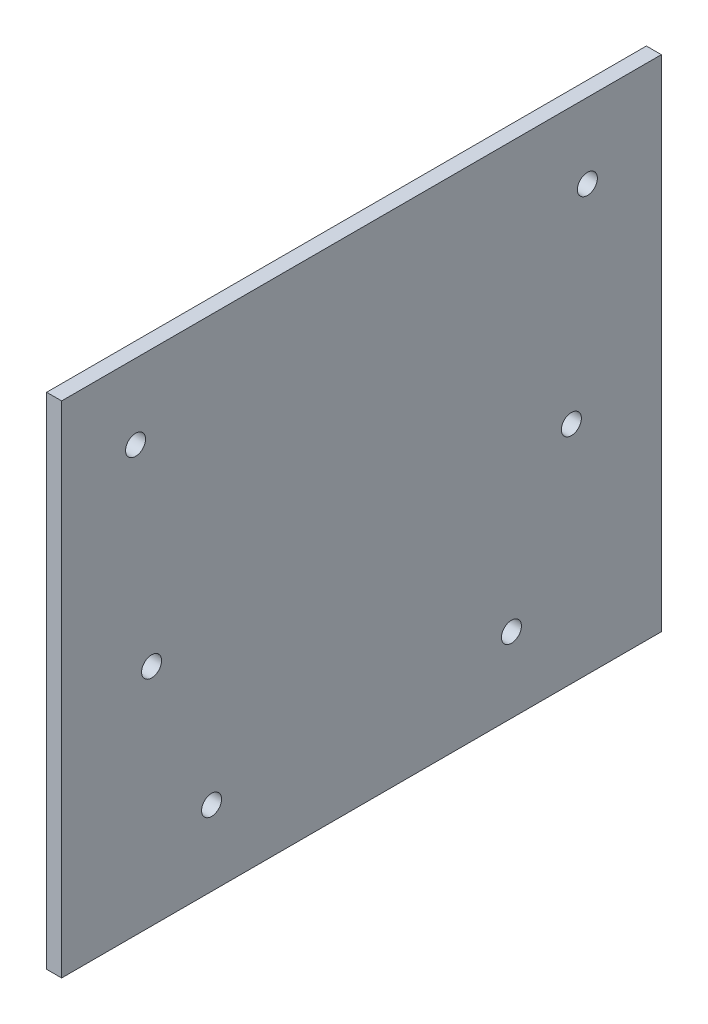
ISO-10303-21;
HEADER;
FILE_DESCRIPTION(('STEP AP214'),'2;1');
FILE_NAME('part.step','',(''),(''),'','','');
FILE_SCHEMA(('AUTOMOTIVE_DESIGN { 1 0 10303 214 1 1 1 1 }'));
ENDSEC;
DATA;
#1=APPLICATION_CONTEXT('core data for automotive mechanical design processes');
#2=APPLICATION_PROTOCOL_DEFINITION('international standard','automotive_design',2000,#1);
#3=PRODUCT_CONTEXT('',#1,'mechanical');
#4=PRODUCT('Part','Part','',(#3));
#5=PRODUCT_RELATED_PRODUCT_CATEGORY('part','',(#4));
#6=PRODUCT_DEFINITION_FORMATION('','',#4);
#7=PRODUCT_DEFINITION_CONTEXT('part definition',#1,'design');
#8=PRODUCT_DEFINITION('design','',#6,#7);
#9=PRODUCT_DEFINITION_SHAPE('','',#8);
#10=(LENGTH_UNIT() NAMED_UNIT(*) SI_UNIT(.MILLI.,.METRE.));
#11=(NAMED_UNIT(*) PLANE_ANGLE_UNIT() SI_UNIT($,.RADIAN.));
#12=(NAMED_UNIT(*) SI_UNIT($,.STERADIAN.) SOLID_ANGLE_UNIT());
#13=UNCERTAINTY_MEASURE_WITH_UNIT(LENGTH_MEASURE(1.E-05),#10,'distance_accuracy_value','');
#14=(GEOMETRIC_REPRESENTATION_CONTEXT(3) GLOBAL_UNCERTAINTY_ASSIGNED_CONTEXT((#13)) GLOBAL_UNIT_ASSIGNED_CONTEXT((#10,
#11,#12)) REPRESENTATION_CONTEXT('',''));
#15=CARTESIAN_POINT('',(0.,0.,0.));
#16=DIRECTION('',(0.,0.,1.));
#17=DIRECTION('',(1.,0.,0.));
#18=AXIS2_PLACEMENT_3D('',#15,#16,#17);
#19=CARTESIAN_POINT('',(3.,49.9810515296332,33.853534625365));
#20=DIRECTION('',(0.,0.,-1.));
#21=DIRECTION('',(0.,1.,0.));
#22=AXIS2_PLACEMENT_3D('',#19,#20,#21);
#23=PLANE('',#22);
#24=DIRECTION('',(0.,-1.,0.));
#25=VECTOR('',#24,1.);
#26=CARTESIAN_POINT('',(0.,49.9810515296332,33.853534625365));
#27=LINE('',#26,#25);
#28=CARTESIAN_POINT('',(0.,49.9810515296332,33.853534625365));
#29=VERTEX_POINT('',#28);
#30=CARTESIAN_POINT('',(0.,-50.0189484703668,33.853534625365));
#31=VERTEX_POINT('',#30);
#32=EDGE_CURVE('E96',#29,#31,#27,.T.);
#33=ORIENTED_EDGE('',*,*,#32,.T.);
#34=DIRECTION('',(-1.,0.,0.));
#35=VECTOR('',#34,1.);
#36=CARTESIAN_POINT('',(3.,-50.0189484703668,33.853534625365));
#37=LINE('',#36,#35);
#38=CARTESIAN_POINT('',(3.,-50.0189484703668,33.853534625365));
#39=VERTEX_POINT('',#38);
#40=EDGE_CURVE('E11',#39,#31,#37,.T.);
#41=ORIENTED_EDGE('',*,*,#40,.F.);
#42=DIRECTION('',(0.,-1.,0.));
#43=VECTOR('',#42,1.);
#44=CARTESIAN_POINT('',(3.,49.9810515296332,33.853534625365));
#45=LINE('',#44,#43);
#46=CARTESIAN_POINT('',(3.,49.9810515296332,33.853534625365));
#47=VERTEX_POINT('',#46);
#48=EDGE_CURVE('E84',#47,#39,#45,.T.);
#49=ORIENTED_EDGE('',*,*,#48,.F.);
#50=DIRECTION('',(-1.,0.,0.));
#51=VECTOR('',#50,1.);
#52=CARTESIAN_POINT('',(3.,49.9810515296332,33.853534625365));
#53=LINE('',#52,#51);
#54=EDGE_CURVE('E92',#47,#29,#53,.T.);
#55=ORIENTED_EDGE('',*,*,#54,.T.);
#56=EDGE_LOOP('',(#33,#41,#49,#55));
#57=FACE_BOUND('',#56,.T.);
#58=ADVANCED_FACE('F33',(#57),#23,.F.);
#59=CARTESIAN_POINT('',(3.,-50.0189484703668,33.853534625365));
#60=DIRECTION('',(0.,1.,0.));
#61=DIRECTION('',(0.,0.,1.));
#62=AXIS2_PLACEMENT_3D('',#59,#60,#61);
#63=PLANE('',#62);
#64=DIRECTION('',(0.,0.,-1.));
#65=VECTOR('',#64,1.);
#66=CARTESIAN_POINT('',(0.,-50.0189484703668,33.853534625365));
#67=LINE('',#66,#65);
#68=CARTESIAN_POINT('',(0.,-50.0189484703668,-86.146465374635));
#69=VERTEX_POINT('',#68);
#70=EDGE_CURVE('E88',#31,#69,#67,.T.);
#71=ORIENTED_EDGE('',*,*,#70,.T.);
#72=DIRECTION('',(-1.,0.,0.));
#73=VECTOR('',#72,1.);
#74=CARTESIAN_POINT('',(3.,-50.0189484703668,-86.146465374635));
#75=LINE('',#74,#73);
#76=CARTESIAN_POINT('',(3.,-50.0189484703668,-86.146465374635));
#77=VERTEX_POINT('',#76);
#78=EDGE_CURVE('E41',#77,#69,#75,.T.);
#79=ORIENTED_EDGE('',*,*,#78,.F.);
#80=DIRECTION('',(0.,0.,-1.));
#81=VECTOR('',#80,1.);
#82=CARTESIAN_POINT('',(3.,-50.0189484703668,33.853534625365));
#83=LINE('',#82,#81);
#84=EDGE_CURVE('E79',#39,#77,#83,.T.);
#85=ORIENTED_EDGE('',*,*,#84,.F.);
#86=ORIENTED_EDGE('',*,*,#40,.T.);
#87=EDGE_LOOP('',(#71,#79,#85,#86));
#88=FACE_BOUND('',#87,.T.);
#89=ADVANCED_FACE('F87',(#88),#63,.F.);
#90=CARTESIAN_POINT('',(3.,49.9810515296332,-86.146465374635));
#91=DIRECTION('',(0.,0.,1.));
#92=DIRECTION('',(0.,-1.,0.));
#93=AXIS2_PLACEMENT_3D('',#90,#91,#92);
#94=PLANE('',#93);
#95=DIRECTION('',(0.,1.,0.));
#96=VECTOR('',#95,1.);
#97=CARTESIAN_POINT('',(0.,49.9810515296332,-86.146465374635));
#98=LINE('',#97,#96);
#99=CARTESIAN_POINT('',(0.,49.9810515296332,-86.146465374635));
#100=VERTEX_POINT('',#99);
#101=EDGE_CURVE('E66',#69,#100,#98,.T.);
#102=ORIENTED_EDGE('',*,*,#101,.T.);
#103=DIRECTION('',(-1.,0.,0.));
#104=VECTOR('',#103,1.);
#105=CARTESIAN_POINT('',(3.,49.9810515296332,-86.146465374635));
#106=LINE('',#105,#104);
#107=CARTESIAN_POINT('',(3.,49.9810515296332,-86.146465374635));
#108=VERTEX_POINT('',#107);
#109=EDGE_CURVE('E89',#108,#100,#106,.T.);
#110=ORIENTED_EDGE('',*,*,#109,.F.);
#111=DIRECTION('',(0.,1.,0.));
#112=VECTOR('',#111,1.);
#113=CARTESIAN_POINT('',(3.,49.9810515296332,-86.146465374635));
#114=LINE('',#113,#112);
#115=EDGE_CURVE('E82',#77,#108,#114,.T.);
#116=ORIENTED_EDGE('',*,*,#115,.F.);
#117=ORIENTED_EDGE('',*,*,#78,.T.);
#118=EDGE_LOOP('',(#102,#110,#116,#117));
#119=FACE_BOUND('',#118,.T.);
#120=ADVANCED_FACE('F90',(#119),#94,.F.);
#121=CARTESIAN_POINT('',(3.,49.9810515296332,33.853534625365));
#122=DIRECTION('',(0.,-1.,0.));
#123=DIRECTION('',(0.,0.,-1.));
#124=AXIS2_PLACEMENT_3D('',#121,#122,#123);
#125=PLANE('',#124);
#126=DIRECTION('',(0.,0.,1.));
#127=VECTOR('',#126,1.);
#128=CARTESIAN_POINT('',(0.,49.9810515296332,33.853534625365));
#129=LINE('',#128,#127);
#130=EDGE_CURVE('E72',#100,#29,#129,.T.);
#131=ORIENTED_EDGE('',*,*,#130,.T.);
#132=ORIENTED_EDGE('',*,*,#54,.F.);
#133=DIRECTION('',(0.,0.,1.));
#134=VECTOR('',#133,1.);
#135=CARTESIAN_POINT('',(3.,49.9810515296332,33.853534625365));
#136=LINE('',#135,#134);
#137=EDGE_CURVE('E49',#108,#47,#136,.T.);
#138=ORIENTED_EDGE('',*,*,#137,.F.);
#139=ORIENTED_EDGE('',*,*,#109,.T.);
#140=EDGE_LOOP('',(#131,#132,#138,#139));
#141=FACE_BOUND('',#140,.T.);
#142=ADVANCED_FACE('F104',(#141),#125,.F.);
#143=CARTESIAN_POINT('',(3.,-50.0189484703668,33.853534625365));
#144=DIRECTION('',(1.,0.,0.));
#145=DIRECTION('',(0.,0.,-1.));
#146=AXIS2_PLACEMENT_3D('',#143,#144,#145);
#147=PLANE('',#146);
#148=CARTESIAN_POINT('',(3.,34.9810515296332,-71.3485064035022));
#149=DIRECTION('',(-1.,0.,0.));
#150=DIRECTION('',(0.,0.,1.));
#151=AXIS2_PLACEMENT_3D('',#148,#149,#150);
#152=CIRCLE('',#151,2.);
#153=CARTESIAN_POINT('',(3.,34.9810515296332,-69.3485064035022));
#154=VERTEX_POINT('',#153);
#155=EDGE_CURVE('E137',#154,#154,#152,.T.);
#156=ORIENTED_EDGE('',*,*,#155,.T.);
#157=EDGE_LOOP('',(#156));
#158=FACE_BOUND('',#157,.T.);
#159=CARTESIAN_POINT('',(3.,34.9810515296332,19.0555756542324));
#160=DIRECTION('',(-1.,0.,0.));
#161=DIRECTION('',(0.,0.,1.));
#162=AXIS2_PLACEMENT_3D('',#159,#160,#161);
#163=CIRCLE('',#162,2.00000000000001);
#164=CARTESIAN_POINT('',(3.,34.9810515296332,21.0555756542324));
#165=VERTEX_POINT('',#164);
#166=EDGE_CURVE('E131',#165,#165,#163,.T.);
#167=ORIENTED_EDGE('',*,*,#166,.T.);
#168=EDGE_LOOP('',(#167));
#169=FACE_BOUND('',#168,.T.);
#170=CARTESIAN_POINT('',(3.,-5.0189484703668,15.853534625365));
#171=DIRECTION('',(-1.,0.,0.));
#172=DIRECTION('',(0.,0.,1.));
#173=AXIS2_PLACEMENT_3D('',#170,#171,#172);
#174=CIRCLE('',#173,2.00000000000001);
#175=CARTESIAN_POINT('',(3.,-5.0189484703668,17.853534625365));
#176=VERTEX_POINT('',#175);
#177=EDGE_CURVE('E125',#176,#176,#174,.T.);
#178=ORIENTED_EDGE('',*,*,#177,.T.);
#179=EDGE_LOOP('',(#178));
#180=FACE_BOUND('',#179,.T.);
#181=CARTESIAN_POINT('',(3.,-5.01894847036681,-68.146465374635));
#182=DIRECTION('',(-1.,0.,0.));
#183=DIRECTION('',(0.,0.,1.));
#184=AXIS2_PLACEMENT_3D('',#181,#182,#183);
#185=CIRCLE('',#184,2.);
#186=CARTESIAN_POINT('',(3.,-5.01894847036681,-66.146465374635));
#187=VERTEX_POINT('',#186);
#188=EDGE_CURVE('E119',#187,#187,#185,.T.);
#189=ORIENTED_EDGE('',*,*,#188,.T.);
#190=EDGE_LOOP('',(#189));
#191=FACE_BOUND('',#190,.T.);
#192=CARTESIAN_POINT('',(3.,-35.0189484703668,-56.146465374635));
#193=DIRECTION('',(1.,0.,0.));
#194=DIRECTION('',(0.,0.,-1.));
#195=AXIS2_PLACEMENT_3D('',#192,#193,#194);
#196=CIRCLE('',#195,2.);
#197=CARTESIAN_POINT('',(3.,-35.0189484703668,-58.146465374635));
#198=VERTEX_POINT('',#197);
#199=EDGE_CURVE('E116',#198,#198,#196,.T.);
#200=ORIENTED_EDGE('',*,*,#199,.F.);
#201=EDGE_LOOP('',(#200));
#202=FACE_BOUND('',#201,.T.);
#203=CARTESIAN_POINT('',(3.,-35.0189484703668,3.85353462536501));
#204=DIRECTION('',(1.,0.,0.));
#205=DIRECTION('',(0.,0.,-1.));
#206=AXIS2_PLACEMENT_3D('',#203,#204,#205);
#207=CIRCLE('',#206,2.);
#208=CARTESIAN_POINT('',(3.,-35.0189484703668,1.853534625365));
#209=VERTEX_POINT('',#208);
#210=EDGE_CURVE('E110',#209,#209,#207,.T.);
#211=ORIENTED_EDGE('',*,*,#210,.F.);
#212=EDGE_LOOP('',(#211));
#213=FACE_BOUND('',#212,.T.);
#214=ORIENTED_EDGE('',*,*,#48,.T.);
#215=ORIENTED_EDGE('',*,*,#84,.T.);
#216=ORIENTED_EDGE('',*,*,#115,.T.);
#217=ORIENTED_EDGE('',*,*,#137,.T.);
#218=EDGE_LOOP('',(#214,#215,#216,#217));
#219=FACE_BOUND('',#218,.T.);
#220=ADVANCED_FACE('F80',(#158,#169,#180,#191,#202,#213,#219),#147,.T.);
#221=CARTESIAN_POINT('',(0.,-50.0189484703668,33.853534625365));
#222=DIRECTION('',(1.,0.,0.));
#223=DIRECTION('',(0.,0.,-1.));
#224=AXIS2_PLACEMENT_3D('',#221,#222,#223);
#225=PLANE('',#224);
#226=CARTESIAN_POINT('',(0.,34.9810515296332,-71.3485064035022));
#227=DIRECTION('',(-1.,0.,0.));
#228=DIRECTION('',(0.,0.,1.));
#229=AXIS2_PLACEMENT_3D('',#226,#227,#228);
#230=CIRCLE('',#229,2.);
#231=CARTESIAN_POINT('',(0.,34.9810515296332,-69.3485064035022));
#232=VERTEX_POINT('',#231);
#233=EDGE_CURVE('E140',#232,#232,#230,.T.);
#234=ORIENTED_EDGE('',*,*,#233,.F.);
#235=EDGE_LOOP('',(#234));
#236=FACE_BOUND('',#235,.T.);
#237=CARTESIAN_POINT('',(0.,34.9810515296332,19.0555756542324));
#238=DIRECTION('',(-1.,0.,0.));
#239=DIRECTION('',(0.,0.,1.));
#240=AXIS2_PLACEMENT_3D('',#237,#238,#239);
#241=CIRCLE('',#240,2.00000000000001);
#242=CARTESIAN_POINT('',(0.,34.9810515296332,21.0555756542324));
#243=VERTEX_POINT('',#242);
#244=EDGE_CURVE('E134',#243,#243,#241,.T.);
#245=ORIENTED_EDGE('',*,*,#244,.F.);
#246=EDGE_LOOP('',(#245));
#247=FACE_BOUND('',#246,.T.);
#248=CARTESIAN_POINT('',(0.,-5.0189484703668,15.853534625365));
#249=DIRECTION('',(-1.,0.,0.));
#250=DIRECTION('',(0.,0.,1.));
#251=AXIS2_PLACEMENT_3D('',#248,#249,#250);
#252=CIRCLE('',#251,2.00000000000001);
#253=CARTESIAN_POINT('',(0.,-5.0189484703668,17.853534625365));
#254=VERTEX_POINT('',#253);
#255=EDGE_CURVE('E128',#254,#254,#252,.T.);
#256=ORIENTED_EDGE('',*,*,#255,.F.);
#257=EDGE_LOOP('',(#256));
#258=FACE_BOUND('',#257,.T.);
#259=CARTESIAN_POINT('',(0.,-5.01894847036681,-68.146465374635));
#260=DIRECTION('',(-1.,0.,0.));
#261=DIRECTION('',(0.,0.,1.));
#262=AXIS2_PLACEMENT_3D('',#259,#260,#261);
#263=CIRCLE('',#262,2.);
#264=CARTESIAN_POINT('',(0.,-5.01894847036681,-66.146465374635));
#265=VERTEX_POINT('',#264);
#266=EDGE_CURVE('E122',#265,#265,#263,.T.);
#267=ORIENTED_EDGE('',*,*,#266,.F.);
#268=EDGE_LOOP('',(#267));
#269=FACE_BOUND('',#268,.T.);
#270=CARTESIAN_POINT('',(0.,-35.0189484703668,-56.146465374635));
#271=DIRECTION('',(1.,0.,0.));
#272=DIRECTION('',(0.,0.,-1.));
#273=AXIS2_PLACEMENT_3D('',#270,#271,#272);
#274=CIRCLE('',#273,2.);
#275=CARTESIAN_POINT('',(0.,-35.0189484703668,-58.146465374635));
#276=VERTEX_POINT('',#275);
#277=EDGE_CURVE('E113',#276,#276,#274,.T.);
#278=ORIENTED_EDGE('',*,*,#277,.T.);
#279=EDGE_LOOP('',(#278));
#280=FACE_BOUND('',#279,.T.);
#281=CARTESIAN_POINT('',(0.,-35.0189484703668,3.85353462536501));
#282=DIRECTION('',(1.,0.,0.));
#283=DIRECTION('',(0.,0.,-1.));
#284=AXIS2_PLACEMENT_3D('',#281,#282,#283);
#285=CIRCLE('',#284,2.);
#286=CARTESIAN_POINT('',(0.,-35.0189484703668,1.853534625365));
#287=VERTEX_POINT('',#286);
#288=EDGE_CURVE('E99',#287,#287,#285,.T.);
#289=ORIENTED_EDGE('',*,*,#288,.T.);
#290=EDGE_LOOP('',(#289));
#291=FACE_BOUND('',#290,.T.);
#292=ORIENTED_EDGE('',*,*,#32,.F.);
#293=ORIENTED_EDGE('',*,*,#130,.F.);
#294=ORIENTED_EDGE('',*,*,#101,.F.);
#295=ORIENTED_EDGE('',*,*,#70,.F.);
#296=EDGE_LOOP('',(#292,#293,#294,#295));
#297=FACE_BOUND('',#296,.T.);
#298=ADVANCED_FACE('F107',(#236,#247,#258,#269,#280,#291,#297),#225,.F.);
#299=CARTESIAN_POINT('',(0.,-35.0189484703668,3.85353462536501));
#300=DIRECTION('',(1.,0.,0.));
#301=DIRECTION('',(0.,0.,-1.));
#302=AXIS2_PLACEMENT_3D('',#299,#300,#301);
#303=CYLINDRICAL_SURFACE('',#302,2.);
#304=ORIENTED_EDGE('',*,*,#288,.F.);
#305=EDGE_LOOP('',(#304));
#306=FACE_BOUND('',#305,.T.);
#307=ORIENTED_EDGE('',*,*,#210,.T.);
#308=EDGE_LOOP('',(#307));
#309=FACE_BOUND('',#308,.T.);
#310=ADVANCED_FACE('F157',(#306,#309),#303,.F.);
#311=CARTESIAN_POINT('',(0.,-35.0189484703668,-56.146465374635));
#312=DIRECTION('',(1.,0.,0.));
#313=DIRECTION('',(0.,0.,-1.));
#314=AXIS2_PLACEMENT_3D('',#311,#312,#313);
#315=CYLINDRICAL_SURFACE('',#314,2.);
#316=ORIENTED_EDGE('',*,*,#277,.F.);
#317=EDGE_LOOP('',(#316));
#318=FACE_BOUND('',#317,.T.);
#319=ORIENTED_EDGE('',*,*,#199,.T.);
#320=EDGE_LOOP('',(#319));
#321=FACE_BOUND('',#320,.T.);
#322=ADVANCED_FACE('F171',(#318,#321),#315,.F.);
#323=CARTESIAN_POINT('',(3.,-5.01894847036681,-68.146465374635));
#324=DIRECTION('',(-1.,0.,0.));
#325=DIRECTION('',(0.,0.,1.));
#326=AXIS2_PLACEMENT_3D('',#323,#324,#325);
#327=CYLINDRICAL_SURFACE('',#326,2.);
#328=ORIENTED_EDGE('',*,*,#188,.F.);
#329=EDGE_LOOP('',(#328));
#330=FACE_BOUND('',#329,.T.);
#331=ORIENTED_EDGE('',*,*,#266,.T.);
#332=EDGE_LOOP('',(#331));
#333=FACE_BOUND('',#332,.T.);
#334=ADVANCED_FACE('F217',(#330,#333),#327,.F.);
#335=CARTESIAN_POINT('',(3.,-5.0189484703668,15.853534625365));
#336=DIRECTION('',(-1.,0.,0.));
#337=DIRECTION('',(0.,0.,1.));
#338=AXIS2_PLACEMENT_3D('',#335,#336,#337);
#339=CYLINDRICAL_SURFACE('',#338,2.00000000000001);
#340=ORIENTED_EDGE('',*,*,#177,.F.);
#341=EDGE_LOOP('',(#340));
#342=FACE_BOUND('',#341,.T.);
#343=ORIENTED_EDGE('',*,*,#255,.T.);
#344=EDGE_LOOP('',(#343));
#345=FACE_BOUND('',#344,.T.);
#346=ADVANCED_FACE('F225',(#342,#345),#339,.F.);
#347=CARTESIAN_POINT('',(3.,34.9810515296332,19.0555756542324));
#348=DIRECTION('',(-1.,0.,0.));
#349=DIRECTION('',(0.,0.,1.));
#350=AXIS2_PLACEMENT_3D('',#347,#348,#349);
#351=CYLINDRICAL_SURFACE('',#350,2.00000000000001);
#352=ORIENTED_EDGE('',*,*,#166,.F.);
#353=EDGE_LOOP('',(#352));
#354=FACE_BOUND('',#353,.T.);
#355=ORIENTED_EDGE('',*,*,#244,.T.);
#356=EDGE_LOOP('',(#355));
#357=FACE_BOUND('',#356,.T.);
#358=ADVANCED_FACE('F151',(#354,#357),#351,.F.);
#359=CARTESIAN_POINT('',(3.,34.9810515296332,-71.3485064035022));
#360=DIRECTION('',(-1.,0.,0.));
#361=DIRECTION('',(0.,0.,1.));
#362=AXIS2_PLACEMENT_3D('',#359,#360,#361);
#363=CYLINDRICAL_SURFACE('',#362,2.);
#364=ORIENTED_EDGE('',*,*,#155,.F.);
#365=EDGE_LOOP('',(#364));
#366=FACE_BOUND('',#365,.T.);
#367=ORIENTED_EDGE('',*,*,#233,.T.);
#368=EDGE_LOOP('',(#367));
#369=FACE_BOUND('',#368,.T.);
#370=ADVANCED_FACE('F148',(#366,#369),#363,.F.);
#371=CLOSED_SHELL('',(#58,#89,#120,#142,#220,#298,#310,#322,#334,#346,#358,#370));
#372=MANIFOLD_SOLID_BREP('B2',#371);
#373=ADVANCED_BREP_SHAPE_REPRESENTATION('',(#18,#372),#14);
#374=SHAPE_DEFINITION_REPRESENTATION(#9,#373);
ENDSEC;
END-ISO-10303-21;
